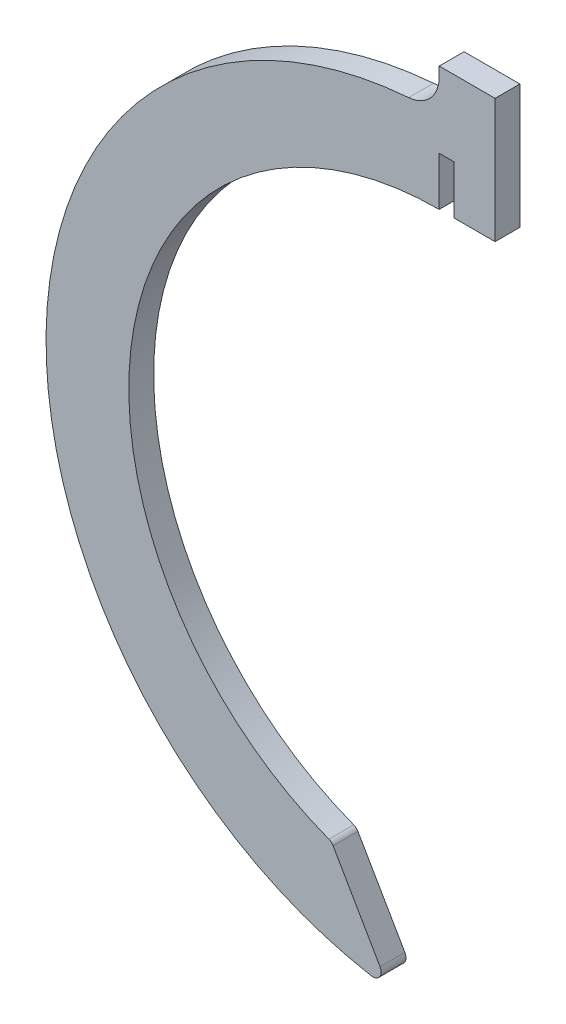
ISO-10303-21;
HEADER;
FILE_DESCRIPTION(('STEP AP214'),'2;1');
FILE_NAME('part.step','',(''),(''),'','','');
FILE_SCHEMA(('AUTOMOTIVE_DESIGN { 1 0 10303 214 1 1 1 1 }'));
ENDSEC;
DATA;
#1=APPLICATION_CONTEXT('core data for automotive mechanical design processes');
#2=APPLICATION_PROTOCOL_DEFINITION('international standard','automotive_design',2000,#1);
#3=PRODUCT_CONTEXT('',#1,'mechanical');
#4=PRODUCT('Part','Part','',(#3));
#5=PRODUCT_RELATED_PRODUCT_CATEGORY('part','',(#4));
#6=PRODUCT_DEFINITION_FORMATION('','',#4);
#7=PRODUCT_DEFINITION_CONTEXT('part definition',#1,'design');
#8=PRODUCT_DEFINITION('design','',#6,#7);
#9=PRODUCT_DEFINITION_SHAPE('','',#8);
#10=(LENGTH_UNIT() NAMED_UNIT(*) SI_UNIT(.MILLI.,.METRE.));
#11=(NAMED_UNIT(*) PLANE_ANGLE_UNIT() SI_UNIT($,.RADIAN.));
#12=(NAMED_UNIT(*) SI_UNIT($,.STERADIAN.) SOLID_ANGLE_UNIT());
#13=UNCERTAINTY_MEASURE_WITH_UNIT(LENGTH_MEASURE(1.E-05),#10,'distance_accuracy_value','');
#14=(GEOMETRIC_REPRESENTATION_CONTEXT(3) GLOBAL_UNCERTAINTY_ASSIGNED_CONTEXT((#13)) GLOBAL_UNIT_ASSIGNED_CONTEXT((#10,
#11,#12)) REPRESENTATION_CONTEXT('',''));
#15=CARTESIAN_POINT('',(0.,0.,0.));
#16=DIRECTION('',(0.,0.,1.));
#17=DIRECTION('',(1.,0.,0.));
#18=AXIS2_PLACEMENT_3D('',#15,#16,#17);
#19=CARTESIAN_POINT('',(0.,43.3767266259856,3.));
#20=DIRECTION('',(0.,1.,0.));
#21=DIRECTION('',(0.,0.,1.));
#22=AXIS2_PLACEMENT_3D('',#19,#20,#21);
#23=PLANE('',#22);
#24=DIRECTION('',(1.,0.,0.));
#25=VECTOR('',#24,1.);
#26=CARTESIAN_POINT('',(0.,43.3767266259856,0.));
#27=LINE('',#26,#25);
#28=CARTESIAN_POINT('',(0.,43.3767266259856,0.));
#29=VERTEX_POINT('',#28);
#30=CARTESIAN_POINT('',(1.79,43.3767266259856,0.));
#31=VERTEX_POINT('',#30);
#32=EDGE_CURVE('E152',#29,#31,#27,.T.);
#33=ORIENTED_EDGE('',*,*,#32,.T.);
#34=DIRECTION('',(0.,0.,-1.));
#35=VECTOR('',#34,1.);
#36=CARTESIAN_POINT('',(1.79,43.3767266259856,3.));
#37=LINE('',#36,#35);
#38=CARTESIAN_POINT('',(1.79,43.3767266259856,3.));
#39=VERTEX_POINT('',#38);
#40=EDGE_CURVE('E133',#39,#31,#37,.T.);
#41=ORIENTED_EDGE('',*,*,#40,.F.);
#42=DIRECTION('',(1.,0.,0.));
#43=VECTOR('',#42,1.);
#44=CARTESIAN_POINT('',(0.,43.3767266259856,3.));
#45=LINE('',#44,#43);
#46=CARTESIAN_POINT('',(0.,43.3767266259856,3.));
#47=VERTEX_POINT('',#46);
#48=EDGE_CURVE('E140',#47,#39,#45,.T.);
#49=ORIENTED_EDGE('',*,*,#48,.F.);
#50=DIRECTION('',(0.,0.,-1.));
#51=VECTOR('',#50,1.);
#52=CARTESIAN_POINT('',(0.,43.3767266259856,3.));
#53=LINE('',#52,#51);
#54=EDGE_CURVE('E201',#47,#29,#53,.T.);
#55=ORIENTED_EDGE('',*,*,#54,.T.);
#56=EDGE_LOOP('',(#33,#41,#49,#55));
#57=FACE_BOUND('',#56,.T.);
#58=ADVANCED_FACE('F34',(#57),#23,.F.);
#59=CARTESIAN_POINT('',(1.79,43.3767266259856,3.));
#60=DIRECTION('',(1.,0.,0.));
#61=DIRECTION('',(0.,1.,0.));
#62=AXIS2_PLACEMENT_3D('',#59,#60,#61);
#63=PLANE('',#62);
#64=DIRECTION('',(0.,-1.,0.));
#65=VECTOR('',#64,1.);
#66=CARTESIAN_POINT('',(1.79,43.3767266259856,0.));
#67=LINE('',#66,#65);
#68=CARTESIAN_POINT('',(1.79,37.5,0.));
#69=VERTEX_POINT('',#68);
#70=EDGE_CURVE('E228',#31,#69,#67,.T.);
#71=ORIENTED_EDGE('',*,*,#70,.T.);
#72=DIRECTION('',(0.,0.,-1.));
#73=VECTOR('',#72,1.);
#74=CARTESIAN_POINT('',(1.79,37.5,3.));
#75=LINE('',#74,#73);
#76=CARTESIAN_POINT('',(1.79,37.5,3.));
#77=VERTEX_POINT('',#76);
#78=EDGE_CURVE('E136',#77,#69,#75,.T.);
#79=ORIENTED_EDGE('',*,*,#78,.F.);
#80=DIRECTION('',(0.,-1.,0.));
#81=VECTOR('',#80,1.);
#82=CARTESIAN_POINT('',(1.79,43.3767266259856,3.));
#83=LINE('',#82,#81);
#84=EDGE_CURVE('E129',#39,#77,#83,.T.);
#85=ORIENTED_EDGE('',*,*,#84,.F.);
#86=ORIENTED_EDGE('',*,*,#40,.T.);
#87=EDGE_LOOP('',(#71,#79,#85,#86));
#88=FACE_BOUND('',#87,.T.);
#89=ADVANCED_FACE('F131',(#88),#63,.F.);
#90=CARTESIAN_POINT('',(1.79,37.5,3.));
#91=DIRECTION('',(0.,1.,0.));
#92=DIRECTION('',(0.,0.,1.));
#93=AXIS2_PLACEMENT_3D('',#90,#91,#92);
#94=PLANE('',#93);
#95=DIRECTION('',(1.,0.,0.));
#96=VECTOR('',#95,1.);
#97=CARTESIAN_POINT('',(1.79,37.5,0.));
#98=LINE('',#97,#96);
#99=CARTESIAN_POINT('',(6.75,37.5,0.));
#100=VERTEX_POINT('',#99);
#101=EDGE_CURVE('E223',#69,#100,#98,.T.);
#102=ORIENTED_EDGE('',*,*,#101,.T.);
#103=DIRECTION('',(0.,0.,-1.));
#104=VECTOR('',#103,1.);
#105=CARTESIAN_POINT('',(6.75,37.5,3.));
#106=LINE('',#105,#104);
#107=CARTESIAN_POINT('',(6.75,37.5,3.));
#108=VERTEX_POINT('',#107);
#109=EDGE_CURVE('E158',#108,#100,#106,.T.);
#110=ORIENTED_EDGE('',*,*,#109,.F.);
#111=DIRECTION('',(1.,0.,0.));
#112=VECTOR('',#111,1.);
#113=CARTESIAN_POINT('',(1.79,37.5,3.));
#114=LINE('',#113,#112);
#115=EDGE_CURVE('E139',#77,#108,#114,.T.);
#116=ORIENTED_EDGE('',*,*,#115,.F.);
#117=ORIENTED_EDGE('',*,*,#78,.T.);
#118=EDGE_LOOP('',(#102,#110,#116,#117));
#119=FACE_BOUND('',#118,.T.);
#120=ADVANCED_FACE('F254',(#119),#94,.F.);
#121=CARTESIAN_POINT('',(6.75,37.5,3.));
#122=DIRECTION('',(-1.,0.,0.));
#123=DIRECTION('',(0.,0.,1.));
#124=AXIS2_PLACEMENT_3D('',#121,#122,#123);
#125=PLANE('',#124);
#126=DIRECTION('',(0.,1.,0.));
#127=VECTOR('',#126,1.);
#128=CARTESIAN_POINT('',(6.75,37.5,0.));
#129=LINE('',#128,#127);
#130=CARTESIAN_POINT('',(6.75,52.5,0.));
#131=VERTEX_POINT('',#130);
#132=EDGE_CURVE('E218',#100,#131,#129,.T.);
#133=ORIENTED_EDGE('',*,*,#132,.T.);
#134=DIRECTION('',(0.,0.,-1.));
#135=VECTOR('',#134,1.);
#136=CARTESIAN_POINT('',(6.75,52.5,3.));
#137=LINE('',#136,#135);
#138=CARTESIAN_POINT('',(6.75,52.5,3.));
#139=VERTEX_POINT('',#138);
#140=EDGE_CURVE('E209',#139,#131,#137,.T.);
#141=ORIENTED_EDGE('',*,*,#140,.F.);
#142=DIRECTION('',(0.,1.,0.));
#143=VECTOR('',#142,1.);
#144=CARTESIAN_POINT('',(6.75,37.5,3.));
#145=LINE('',#144,#143);
#146=EDGE_CURVE('E219',#108,#139,#145,.T.);
#147=ORIENTED_EDGE('',*,*,#146,.F.);
#148=ORIENTED_EDGE('',*,*,#109,.T.);
#149=EDGE_LOOP('',(#133,#141,#147,#148));
#150=FACE_BOUND('',#149,.T.);
#151=ADVANCED_FACE('F216',(#150),#125,.F.);
#152=CARTESIAN_POINT('',(0.,52.5,3.));
#153=DIRECTION('',(0.,-1.,0.));
#154=DIRECTION('',(0.,0.,-1.));
#155=AXIS2_PLACEMENT_3D('',#152,#153,#154);
#156=PLANE('',#155);
#157=DIRECTION('',(-1.,0.,0.));
#158=VECTOR('',#157,1.);
#159=CARTESIAN_POINT('',(0.,52.5,0.));
#160=LINE('',#159,#158);
#161=CARTESIAN_POINT('',(0.,52.5,0.));
#162=VERTEX_POINT('',#161);
#163=EDGE_CURVE('E225',#131,#162,#160,.T.);
#164=ORIENTED_EDGE('',*,*,#163,.T.);
#165=DIRECTION('',(0.,0.,-1.));
#166=VECTOR('',#165,1.);
#167=CARTESIAN_POINT('',(0.,52.5,3.));
#168=LINE('',#167,#166);
#169=CARTESIAN_POINT('',(0.,52.5,3.));
#170=VERTEX_POINT('',#169);
#171=EDGE_CURVE('E206',#170,#162,#168,.T.);
#172=ORIENTED_EDGE('',*,*,#171,.F.);
#173=DIRECTION('',(-1.,0.,0.));
#174=VECTOR('',#173,1.);
#175=CARTESIAN_POINT('',(0.,52.5,3.));
#176=LINE('',#175,#174);
#177=EDGE_CURVE('E248',#139,#170,#176,.T.);
#178=ORIENTED_EDGE('',*,*,#177,.F.);
#179=ORIENTED_EDGE('',*,*,#140,.T.);
#180=EDGE_LOOP('',(#164,#172,#178,#179));
#181=FACE_BOUND('',#180,.T.);
#182=ADVANCED_FACE('F259',(#181),#156,.F.);
#183=CARTESIAN_POINT('',(0.,47.5,3.));
#184=DIRECTION('',(1.,0.,0.));
#185=DIRECTION('',(0.,0.,-1.));
#186=AXIS2_PLACEMENT_3D('',#183,#184,#185);
#187=PLANE('',#186);
#188=DIRECTION('',(0.,-1.,0.));
#189=VECTOR('',#188,1.);
#190=CARTESIAN_POINT('',(0.,47.5,0.));
#191=LINE('',#190,#189);
#192=CARTESIAN_POINT('',(0.,51.3444252085852,0.));
#193=VERTEX_POINT('',#192);
#194=EDGE_CURVE('E196',#162,#193,#191,.T.);
#195=ORIENTED_EDGE('',*,*,#194,.T.);
#196=DIRECTION('',(0.,0.,1.));
#197=VECTOR('',#196,1.);
#198=CARTESIAN_POINT('',(0.,51.3444252085852,3.));
#199=LINE('',#198,#197);
#200=CARTESIAN_POINT('',(0.,51.3444252085852,3.));
#201=VERTEX_POINT('',#200);
#202=EDGE_CURVE('E156',#193,#201,#199,.T.);
#203=ORIENTED_EDGE('',*,*,#202,.T.);
#204=DIRECTION('',(0.,-1.,0.));
#205=VECTOR('',#204,1.);
#206=CARTESIAN_POINT('',(0.,47.5,3.));
#207=LINE('',#206,#205);
#208=EDGE_CURVE('E243',#170,#201,#207,.T.);
#209=ORIENTED_EDGE('',*,*,#208,.F.);
#210=ORIENTED_EDGE('',*,*,#171,.T.);
#211=EDGE_LOOP('',(#195,#203,#209,#210));
#212=FACE_BOUND('',#211,.T.);
#213=ADVANCED_FACE('F234',(#212),#187,.F.);
#214=CARTESIAN_POINT('',(0.,0.,3.));
#215=DIRECTION('',(0.,0.,-1.));
#216=DIRECTION('',(-1.,0.,0.));
#217=AXIS2_PLACEMENT_3D('',#214,#215,#216);
#218=CYLINDRICAL_SURFACE('',#217,47.5);
#219=CARTESIAN_POINT('',(0.,0.,0.));
#220=DIRECTION('',(0.,0.,1.));
#221=DIRECTION('',(1.,0.,0.));
#222=AXIS2_PLACEMENT_3D('',#219,#220,#221);
#223=CIRCLE('',#222,47.5);
#224=CARTESIAN_POINT('',(-3.68932038834951,47.3565086875301,0.));
#225=VERTEX_POINT('',#224);
#226=CARTESIAN_POINT('',(-8.18643653183637,-46.7892322752812,0.));
#227=VERTEX_POINT('',#226);
#228=EDGE_CURVE('E193',#225,#227,#223,.T.);
#229=ORIENTED_EDGE('',*,*,#228,.T.);
#230=DIRECTION('',(0.,0.,-1.));
#231=VECTOR('',#230,1.);
#232=CARTESIAN_POINT('',(-8.18643653183638,-46.7892322752812,3.));
#233=LINE('',#232,#231);
#234=CARTESIAN_POINT('',(-8.18643653183637,-46.7892322752812,3.));
#235=VERTEX_POINT('',#234);
#236=EDGE_CURVE('E42',#227,#235,#233,.F.);
#237=ORIENTED_EDGE('',*,*,#236,.T.);
#238=CARTESIAN_POINT('',(0.,0.,3.));
#239=DIRECTION('',(0.,0.,1.));
#240=DIRECTION('',(1.,0.,0.));
#241=AXIS2_PLACEMENT_3D('',#238,#239,#240);
#242=CIRCLE('',#241,47.5);
#243=CARTESIAN_POINT('',(-3.68932038834951,47.3565086875301,3.));
#244=VERTEX_POINT('',#243);
#245=EDGE_CURVE('E242',#244,#235,#242,.T.);
#246=ORIENTED_EDGE('',*,*,#245,.F.);
#247=DIRECTION('',(0.,0.,-1.));
#248=VECTOR('',#247,1.);
#249=CARTESIAN_POINT('',(-3.68932038834952,47.3565086875301,3.));
#250=LINE('',#249,#248);
#251=EDGE_CURVE('E153',#244,#225,#250,.T.);
#252=ORIENTED_EDGE('',*,*,#251,.T.);
#253=EDGE_LOOP('',(#229,#237,#246,#252));
#254=FACE_BOUND('',#253,.T.);
#255=ADVANCED_FACE('F244',(#254),#218,.T.);
#256=CARTESIAN_POINT('',(-12.9954368697371,-35.1762508031296,3.));
#257=DIRECTION('',(-0.866025403784437,-0.500000000000003,0.));
#258=DIRECTION('',(0.500000000000003,-0.866025403784437,0.));
#259=AXIS2_PLACEMENT_3D('',#256,#257,#258);
#260=PLANE('',#259);
#261=DIRECTION('',(-0.500000000000003,0.866025403784437,0.));
#262=VECTOR('',#261,1.);
#263=CARTESIAN_POINT('',(-12.9954368697371,-35.1762508031296,3.));
#264=LINE('',#263,#262);
#265=CARTESIAN_POINT('',(-7.14806509580276,-45.3041958063279,3.));
#266=VERTEX_POINT('',#265);
#267=CARTESIAN_POINT('',(-12.8161561862696,-35.4867740557109,3.));
#268=VERTEX_POINT('',#267);
#269=EDGE_CURVE('E186',#266,#268,#264,.T.);
#270=ORIENTED_EDGE('',*,*,#269,.F.);
#271=DIRECTION('',(0.,0.,-1.));
#272=VECTOR('',#271,1.);
#273=CARTESIAN_POINT('',(-7.14806509580276,-45.3041958063279,3.));
#274=LINE('',#273,#272);
#275=CARTESIAN_POINT('',(-7.14806509580276,-45.3041958063279,0.));
#276=VERTEX_POINT('',#275);
#277=EDGE_CURVE('E178',#266,#276,#274,.T.);
#278=ORIENTED_EDGE('',*,*,#277,.T.);
#279=DIRECTION('',(-0.500000000000003,0.866025403784437,0.));
#280=VECTOR('',#279,1.);
#281=CARTESIAN_POINT('',(-12.9954368697371,-35.1762508031296,0.));
#282=LINE('',#281,#280);
#283=CARTESIAN_POINT('',(-12.8161561862696,-35.4867740557109,0.));
#284=VERTEX_POINT('',#283);
#285=EDGE_CURVE('E185',#276,#284,#282,.T.);
#286=ORIENTED_EDGE('',*,*,#285,.T.);
#287=DIRECTION('',(0.,0.,-1.));
#288=VECTOR('',#287,1.);
#289=CARTESIAN_POINT('',(-12.8161561862696,-35.4867740557109,3.));
#290=LINE('',#289,#288);
#291=EDGE_CURVE('E173',#284,#268,#290,.F.);
#292=ORIENTED_EDGE('',*,*,#291,.T.);
#293=EDGE_LOOP('',(#270,#278,#286,#292));
#294=FACE_BOUND('',#293,.T.);
#295=ADVANCED_FACE('F184',(#294),#260,.F.);
#296=CARTESIAN_POINT('',(0.,0.,3.));
#297=DIRECTION('',(0.,0.,-1.));
#298=DIRECTION('',(-1.,0.,0.));
#299=AXIS2_PLACEMENT_3D('',#296,#297,#298);
#300=CYLINDRICAL_SURFACE('',#299,37.5);
#301=CARTESIAN_POINT('',(0.,0.,3.));
#302=DIRECTION('',(0.,0.,-1.));
#303=DIRECTION('',(1.,0.,0.));
#304=AXIS2_PLACEMENT_3D('',#301,#302,#303);
#305=CIRCLE('',#304,37.5);
#306=CARTESIAN_POINT('',(-13.3268002500527,-35.0520526516664,3.));
#307=VERTEX_POINT('',#306);
#308=CARTESIAN_POINT('',(0.,37.5,3.));
#309=VERTEX_POINT('',#308);
#310=EDGE_CURVE('E246',#307,#309,#305,.T.);
#311=ORIENTED_EDGE('',*,*,#310,.F.);
#312=DIRECTION('',(0.,0.,-1.));
#313=VECTOR('',#312,1.);
#314=CARTESIAN_POINT('',(-13.3268002500527,-35.0520526516664,3.));
#315=LINE('',#314,#313);
#316=CARTESIAN_POINT('',(-13.3268002500527,-35.0520526516664,0.));
#317=VERTEX_POINT('',#316);
#318=EDGE_CURVE('E167',#307,#317,#315,.T.);
#319=ORIENTED_EDGE('',*,*,#318,.T.);
#320=CARTESIAN_POINT('',(0.,0.,0.));
#321=DIRECTION('',(0.,0.,-1.));
#322=DIRECTION('',(1.,0.,0.));
#323=AXIS2_PLACEMENT_3D('',#320,#321,#322);
#324=CIRCLE('',#323,37.5);
#325=CARTESIAN_POINT('',(0.,37.5,0.));
#326=VERTEX_POINT('',#325);
#327=EDGE_CURVE('E192',#317,#326,#324,.T.);
#328=ORIENTED_EDGE('',*,*,#327,.T.);
#329=DIRECTION('',(0.,0.,-1.));
#330=VECTOR('',#329,1.);
#331=CARTESIAN_POINT('',(0.,37.5,3.));
#332=LINE('',#331,#330);
#333=EDGE_CURVE('E203',#309,#326,#332,.T.);
#334=ORIENTED_EDGE('',*,*,#333,.F.);
#335=EDGE_LOOP('',(#311,#319,#328,#334));
#336=FACE_BOUND('',#335,.T.);
#337=ADVANCED_FACE('F288',(#336),#300,.F.);
#338=CARTESIAN_POINT('',(0.,43.3767266259856,3.));
#339=DIRECTION('',(-1.,0.,0.));
#340=DIRECTION('',(0.,0.,1.));
#341=AXIS2_PLACEMENT_3D('',#338,#339,#340);
#342=PLANE('',#341);
#343=DIRECTION('',(0.,1.,0.));
#344=VECTOR('',#343,1.);
#345=CARTESIAN_POINT('',(0.,43.3767266259856,0.));
#346=LINE('',#345,#344);
#347=EDGE_CURVE('E149',#326,#29,#346,.T.);
#348=ORIENTED_EDGE('',*,*,#347,.T.);
#349=ORIENTED_EDGE('',*,*,#54,.F.);
#350=DIRECTION('',(0.,1.,0.));
#351=VECTOR('',#350,1.);
#352=CARTESIAN_POINT('',(0.,43.3767266259856,3.));
#353=LINE('',#352,#351);
#354=EDGE_CURVE('E145',#309,#47,#353,.T.);
#355=ORIENTED_EDGE('',*,*,#354,.F.);
#356=ORIENTED_EDGE('',*,*,#333,.T.);
#357=EDGE_LOOP('',(#348,#349,#355,#356));
#358=FACE_BOUND('',#357,.T.);
#359=ADVANCED_FACE('F291',(#358),#342,.F.);
#360=CARTESIAN_POINT('',(0.,0.,3.));
#361=DIRECTION('',(0.,0.,1.));
#362=DIRECTION('',(1.,0.,0.));
#363=AXIS2_PLACEMENT_3D('',#360,#361,#362);
#364=PLANE('',#363);
#365=ORIENTED_EDGE('',*,*,#245,.T.);
#366=CARTESIAN_POINT('',(-8.01409049958719,-45.8041958063279,3.));
#367=DIRECTION('',(0.,0.,1.));
#368=DIRECTION('',(1.,0.,0.));
#369=AXIS2_PLACEMENT_3D('',#366,#367,#368);
#370=CIRCLE('',#369,1.);
#371=EDGE_CURVE('E11',#235,#266,#370,.T.);
#372=ORIENTED_EDGE('',*,*,#371,.T.);
#373=ORIENTED_EDGE('',*,*,#269,.T.);
#374=CARTESIAN_POINT('',(-13.6821815900541,-35.9867740557109,3.));
#375=DIRECTION('',(0.,0.,1.));
#376=DIRECTION('',(1.,0.,0.));
#377=AXIS2_PLACEMENT_3D('',#374,#375,#376);
#378=CIRCLE('',#377,1.);
#379=EDGE_CURVE('E176',#268,#307,#378,.T.);
#380=ORIENTED_EDGE('',*,*,#379,.T.);
#381=ORIENTED_EDGE('',*,*,#310,.T.);
#382=ORIENTED_EDGE('',*,*,#354,.T.);
#383=ORIENTED_EDGE('',*,*,#48,.T.);
#384=ORIENTED_EDGE('',*,*,#84,.T.);
#385=ORIENTED_EDGE('',*,*,#115,.T.);
#386=ORIENTED_EDGE('',*,*,#146,.T.);
#387=ORIENTED_EDGE('',*,*,#177,.T.);
#388=ORIENTED_EDGE('',*,*,#208,.T.);
#389=CARTESIAN_POINT('',(-4.,51.3444252085852,3.));
#390=DIRECTION('',(0.,0.,1.));
#391=DIRECTION('',(1.,0.,0.));
#392=AXIS2_PLACEMENT_3D('',#389,#390,#391);
#393=CIRCLE('',#392,4.);
#394=EDGE_CURVE('E165',#201,#244,#393,.F.);
#395=ORIENTED_EDGE('',*,*,#394,.T.);
#396=EDGE_LOOP('',(#365,#372,#373,#380,#381,#382,#383,#384,#385,#386,#387,#388,#395));
#397=FACE_BOUND('',#396,.T.);
#398=ADVANCED_FACE('F143',(#397),#364,.T.);
#399=CARTESIAN_POINT('',(0.,0.,0.));
#400=DIRECTION('',(0.,0.,1.));
#401=DIRECTION('',(1.,0.,0.));
#402=AXIS2_PLACEMENT_3D('',#399,#400,#401);
#403=PLANE('',#402);
#404=ORIENTED_EDGE('',*,*,#285,.F.);
#405=CARTESIAN_POINT('',(-8.01409049958719,-45.8041958063279,0.));
#406=DIRECTION('',(0.,0.,1.));
#407=DIRECTION('',(1.,0.,0.));
#408=AXIS2_PLACEMENT_3D('',#405,#406,#407);
#409=CIRCLE('',#408,1.);
#410=EDGE_CURVE('E56',#276,#227,#409,.F.);
#411=ORIENTED_EDGE('',*,*,#410,.T.);
#412=ORIENTED_EDGE('',*,*,#228,.F.);
#413=CARTESIAN_POINT('',(-4.,51.3444252085852,0.));
#414=DIRECTION('',(0.,0.,1.));
#415=DIRECTION('',(1.,0.,0.));
#416=AXIS2_PLACEMENT_3D('',#413,#414,#415);
#417=CIRCLE('',#416,4.);
#418=EDGE_CURVE('E163',#225,#193,#417,.T.);
#419=ORIENTED_EDGE('',*,*,#418,.T.);
#420=ORIENTED_EDGE('',*,*,#194,.F.);
#421=ORIENTED_EDGE('',*,*,#163,.F.);
#422=ORIENTED_EDGE('',*,*,#132,.F.);
#423=ORIENTED_EDGE('',*,*,#101,.F.);
#424=ORIENTED_EDGE('',*,*,#70,.F.);
#425=ORIENTED_EDGE('',*,*,#32,.F.);
#426=ORIENTED_EDGE('',*,*,#347,.F.);
#427=ORIENTED_EDGE('',*,*,#327,.F.);
#428=CARTESIAN_POINT('',(-13.6821815900541,-35.9867740557109,0.));
#429=DIRECTION('',(0.,0.,1.));
#430=DIRECTION('',(1.,0.,0.));
#431=AXIS2_PLACEMENT_3D('',#428,#429,#430);
#432=CIRCLE('',#431,1.);
#433=EDGE_CURVE('E170',#317,#284,#432,.F.);
#434=ORIENTED_EDGE('',*,*,#433,.T.);
#435=EDGE_LOOP('',(#404,#411,#412,#419,#420,#421,#422,#423,#424,#425,#426,#427,#434));
#436=FACE_BOUND('',#435,.T.);
#437=ADVANCED_FACE('F189',(#436),#403,.F.);
#438=CARTESIAN_POINT('',(-4.,51.3444252085852,3.));
#439=DIRECTION('',(0.,0.,-1.));
#440=DIRECTION('',(-1.,0.,0.));
#441=AXIS2_PLACEMENT_3D('',#438,#439,#440);
#442=CYLINDRICAL_SURFACE('',#441,4.);
#443=ORIENTED_EDGE('',*,*,#394,.F.);
#444=ORIENTED_EDGE('',*,*,#202,.F.);
#445=ORIENTED_EDGE('',*,*,#418,.F.);
#446=ORIENTED_EDGE('',*,*,#251,.F.);
#447=EDGE_LOOP('',(#443,#444,#445,#446));
#448=FACE_BOUND('',#447,.T.);
#449=ADVANCED_FACE('F240',(#448),#442,.F.);
#450=CARTESIAN_POINT('',(-13.6821815900541,-35.9867740557109,3.));
#451=DIRECTION('',(0.,0.,-1.));
#452=DIRECTION('',(-1.,0.,0.));
#453=AXIS2_PLACEMENT_3D('',#450,#451,#452);
#454=CYLINDRICAL_SURFACE('',#453,1.);
#455=ORIENTED_EDGE('',*,*,#379,.F.);
#456=ORIENTED_EDGE('',*,*,#291,.F.);
#457=ORIENTED_EDGE('',*,*,#433,.F.);
#458=ORIENTED_EDGE('',*,*,#318,.F.);
#459=EDGE_LOOP('',(#455,#456,#457,#458));
#460=FACE_BOUND('',#459,.T.);
#461=ADVANCED_FACE('F277',(#460),#454,.T.);
#462=CARTESIAN_POINT('',(-8.01409049958719,-45.8041958063279,3.));
#463=DIRECTION('',(0.,0.,-1.));
#464=DIRECTION('',(-1.,0.,0.));
#465=AXIS2_PLACEMENT_3D('',#462,#463,#464);
#466=CYLINDRICAL_SURFACE('',#465,1.);
#467=ORIENTED_EDGE('',*,*,#371,.F.);
#468=ORIENTED_EDGE('',*,*,#236,.F.);
#469=ORIENTED_EDGE('',*,*,#410,.F.);
#470=ORIENTED_EDGE('',*,*,#277,.F.);
#471=EDGE_LOOP('',(#467,#468,#469,#470));
#472=FACE_BOUND('',#471,.T.);
#473=ADVANCED_FACE('F36',(#472),#466,.T.);
#474=CLOSED_SHELL('',(#58,#89,#120,#151,#182,#213,#255,#295,#337,#359,#398,#437,#449,#461,#473));
#475=MANIFOLD_SOLID_BREP('B2',#474);
#476=ADVANCED_BREP_SHAPE_REPRESENTATION('',(#18,#475),#14);
#477=SHAPE_DEFINITION_REPRESENTATION(#9,#476);
ENDSEC;
END-ISO-10303-21;
